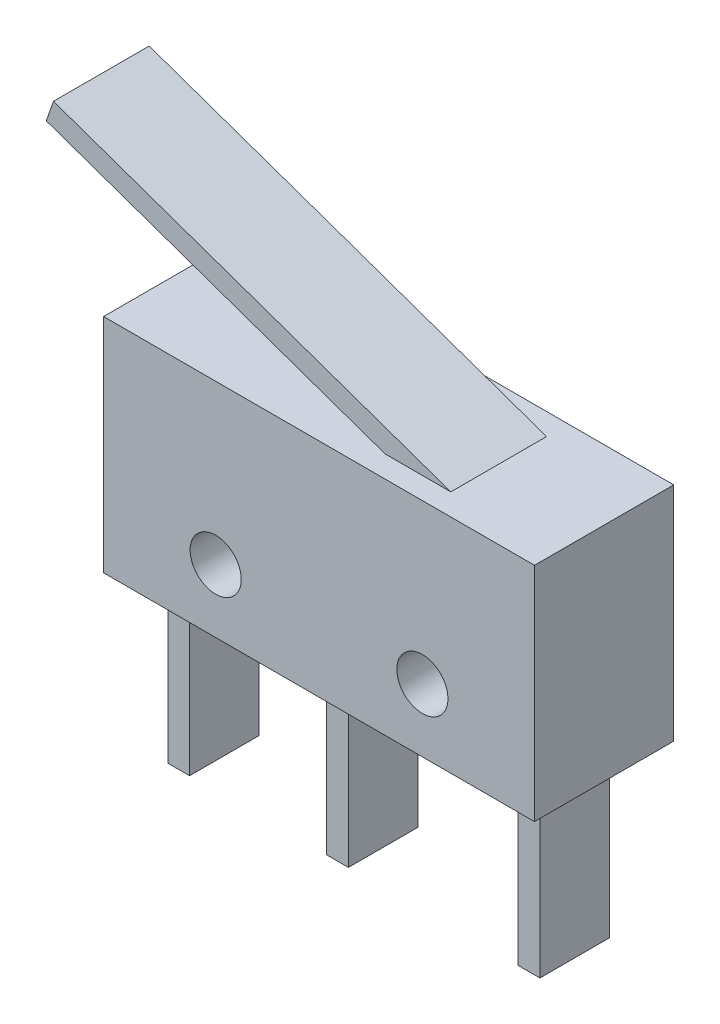
ISO-10303-21;
HEADER;
FILE_DESCRIPTION(('STEP AP214'),'2;1');
FILE_NAME('part.step','',(''),(''),'','','');
FILE_SCHEMA(('AUTOMOTIVE_DESIGN { 1 0 10303 214 1 1 1 1 }'));
ENDSEC;
DATA;
#1=APPLICATION_CONTEXT('core data for automotive mechanical design processes');
#2=APPLICATION_PROTOCOL_DEFINITION('international standard','automotive_design',2000,#1);
#3=PRODUCT_CONTEXT('',#1,'mechanical');
#4=PRODUCT('Part','Part','',(#3));
#5=PRODUCT_RELATED_PRODUCT_CATEGORY('part','',(#4));
#6=PRODUCT_DEFINITION_FORMATION('','',#4);
#7=PRODUCT_DEFINITION_CONTEXT('part definition',#1,'design');
#8=PRODUCT_DEFINITION('design','',#6,#7);
#9=PRODUCT_DEFINITION_SHAPE('','',#8);
#10=(LENGTH_UNIT() NAMED_UNIT(*) SI_UNIT(.MILLI.,.METRE.));
#11=(NAMED_UNIT(*) PLANE_ANGLE_UNIT() SI_UNIT($,.RADIAN.));
#12=(NAMED_UNIT(*) SI_UNIT($,.STERADIAN.) SOLID_ANGLE_UNIT());
#13=UNCERTAINTY_MEASURE_WITH_UNIT(LENGTH_MEASURE(1.E-05),#10,'distance_accuracy_value','');
#14=(GEOMETRIC_REPRESENTATION_CONTEXT(3) GLOBAL_UNCERTAINTY_ASSIGNED_CONTEXT((#13)) GLOBAL_UNIT_ASSIGNED_CONTEXT((#10,
#11,#12)) REPRESENTATION_CONTEXT('',''));
#15=CARTESIAN_POINT('',(0.,0.,0.));
#16=DIRECTION('',(0.,0.,1.));
#17=DIRECTION('',(1.,0.,0.));
#18=AXIS2_PLACEMENT_3D('',#15,#16,#17);
#19=CARTESIAN_POINT('',(-9.9,-5.1,6.4));
#20=DIRECTION('',(0.,1.,0.));
#21=DIRECTION('',(0.,0.,1.));
#22=AXIS2_PLACEMENT_3D('',#19,#20,#21);
#23=PLANE('',#22);
#24=DIRECTION('',(0.,0.,1.));
#25=VECTOR('',#24,1.);
#26=CARTESIAN_POINT('',(-0.249999999999999,-5.1,1.6));
#27=LINE('',#26,#25);
#28=CARTESIAN_POINT('',(-0.249999999999999,-5.1,1.6));
#29=VERTEX_POINT('',#28);
#30=CARTESIAN_POINT('',(-0.249999999999999,-5.1,4.8));
#31=VERTEX_POINT('',#30);
#32=EDGE_CURVE('E231',#29,#31,#27,.T.);
#33=ORIENTED_EDGE('',*,*,#32,.F.);
#34=DIRECTION('',(-1.,0.,0.));
#35=VECTOR('',#34,1.);
#36=CARTESIAN_POINT('',(-0.249999999999999,-5.1,1.6));
#37=LINE('',#36,#35);
#38=CARTESIAN_POINT('',(-1.25,-5.1,1.6));
#39=VERTEX_POINT('',#38);
#40=EDGE_CURVE('E236',#29,#39,#37,.T.);
#41=ORIENTED_EDGE('',*,*,#40,.T.);
#42=DIRECTION('',(0.,0.,1.));
#43=VECTOR('',#42,1.);
#44=CARTESIAN_POINT('',(-1.25,-5.1,1.6));
#45=LINE('',#44,#43);
#46=CARTESIAN_POINT('',(-1.25,-5.1,4.8));
#47=VERTEX_POINT('',#46);
#48=EDGE_CURVE('E252',#39,#47,#45,.T.);
#49=ORIENTED_EDGE('',*,*,#48,.T.);
#50=DIRECTION('',(1.,0.,0.));
#51=VECTOR('',#50,1.);
#52=CARTESIAN_POINT('',(-1.25,-5.1,4.8));
#53=LINE('',#52,#51);
#54=EDGE_CURVE('E249',#47,#31,#53,.T.);
#55=ORIENTED_EDGE('',*,*,#54,.T.);
#56=EDGE_LOOP('',(#33,#41,#49,#55));
#57=FACE_BOUND('',#56,.T.);
#58=DIRECTION('',(1.,0.,0.));
#59=VECTOR('',#58,1.);
#60=CARTESIAN_POINT('',(-9.9,-5.1,0.));
#61=LINE('',#60,#59);
#62=CARTESIAN_POINT('',(-9.9,-5.1,0.));
#63=VERTEX_POINT('',#62);
#64=CARTESIAN_POINT('',(9.9,-5.1,0.));
#65=VERTEX_POINT('',#64);
#66=EDGE_CURVE('E322',#63,#65,#61,.T.);
#67=ORIENTED_EDGE('',*,*,#66,.T.);
#68=DIRECTION('',(0.,0.,-1.));
#69=VECTOR('',#68,1.);
#70=CARTESIAN_POINT('',(9.9,-5.1,6.4));
#71=LINE('',#70,#69);
#72=CARTESIAN_POINT('',(9.9,-5.1,6.4));
#73=VERTEX_POINT('',#72);
#74=EDGE_CURVE('E331',#73,#65,#71,.T.);
#75=ORIENTED_EDGE('',*,*,#74,.F.);
#76=DIRECTION('',(1.,0.,0.));
#77=VECTOR('',#76,1.);
#78=CARTESIAN_POINT('',(-9.9,-5.1,6.4));
#79=LINE('',#78,#77);
#80=CARTESIAN_POINT('',(-9.9,-5.1,6.4));
#81=VERTEX_POINT('',#80);
#82=EDGE_CURVE('E328',#81,#73,#79,.T.);
#83=ORIENTED_EDGE('',*,*,#82,.F.);
#84=DIRECTION('',(0.,0.,-1.));
#85=VECTOR('',#84,1.);
#86=CARTESIAN_POINT('',(-9.9,-5.1,6.4));
#87=LINE('',#86,#85);
#88=EDGE_CURVE('E344',#81,#63,#87,.T.);
#89=ORIENTED_EDGE('',*,*,#88,.T.);
#90=EDGE_LOOP('',(#67,#75,#83,#89));
#91=FACE_BOUND('',#90,.T.);
#92=DIRECTION('',(0.,0.,-1.));
#93=VECTOR('',#92,1.);
#94=CARTESIAN_POINT('',(8.55,-5.1,1.6));
#95=LINE('',#94,#93);
#96=CARTESIAN_POINT('',(8.55,-5.1,1.6));
#97=VERTEX_POINT('',#96);
#98=CARTESIAN_POINT('',(8.55,-5.1,4.8));
#99=VERTEX_POINT('',#98);
#100=EDGE_CURVE('E267',#97,#99,#95,.F.);
#101=ORIENTED_EDGE('',*,*,#100,.F.);
#102=DIRECTION('',(-1.,0.,0.));
#103=VECTOR('',#102,1.);
#104=CARTESIAN_POINT('',(8.55,-5.1,1.6));
#105=LINE('',#104,#103);
#106=CARTESIAN_POINT('',(7.55,-5.1,1.6));
#107=VERTEX_POINT('',#106);
#108=EDGE_CURVE('E271',#97,#107,#105,.T.);
#109=ORIENTED_EDGE('',*,*,#108,.T.);
#110=DIRECTION('',(0.,0.,-1.));
#111=VECTOR('',#110,1.);
#112=CARTESIAN_POINT('',(7.55,-5.1,1.6));
#113=LINE('',#112,#111);
#114=CARTESIAN_POINT('',(7.55,-5.1,4.8));
#115=VERTEX_POINT('',#114);
#116=EDGE_CURVE('E287',#107,#115,#113,.F.);
#117=ORIENTED_EDGE('',*,*,#116,.T.);
#118=DIRECTION('',(1.,0.,0.));
#119=VECTOR('',#118,1.);
#120=CARTESIAN_POINT('',(7.55,-5.1,4.8));
#121=LINE('',#120,#119);
#122=EDGE_CURVE('E283',#115,#99,#121,.T.);
#123=ORIENTED_EDGE('',*,*,#122,.T.);
#124=EDGE_LOOP('',(#101,#109,#117,#123));
#125=FACE_BOUND('',#124,.T.);
#126=DIRECTION('',(0.,0.,-1.));
#127=VECTOR('',#126,1.);
#128=CARTESIAN_POINT('',(-7.55,-5.1,1.6));
#129=LINE('',#128,#127);
#130=CARTESIAN_POINT('',(-7.55,-5.1,1.6));
#131=VERTEX_POINT('',#130);
#132=CARTESIAN_POINT('',(-7.55,-5.1,4.8));
#133=VERTEX_POINT('',#132);
#134=EDGE_CURVE('E211',#131,#133,#129,.F.);
#135=ORIENTED_EDGE('',*,*,#134,.F.);
#136=DIRECTION('',(-1.,0.,0.));
#137=VECTOR('',#136,1.);
#138=CARTESIAN_POINT('',(-7.55,-5.1,1.6));
#139=LINE('',#138,#137);
#140=CARTESIAN_POINT('',(-8.55,-5.1,1.6));
#141=VERTEX_POINT('',#140);
#142=EDGE_CURVE('E201',#131,#141,#139,.T.);
#143=ORIENTED_EDGE('',*,*,#142,.T.);
#144=DIRECTION('',(0.,0.,-1.));
#145=VECTOR('',#144,1.);
#146=CARTESIAN_POINT('',(-8.55,-5.1,1.6));
#147=LINE('',#146,#145);
#148=CARTESIAN_POINT('',(-8.55,-5.1,4.8));
#149=VERTEX_POINT('',#148);
#150=EDGE_CURVE('E217',#141,#149,#147,.F.);
#151=ORIENTED_EDGE('',*,*,#150,.T.);
#152=DIRECTION('',(1.,0.,0.));
#153=VECTOR('',#152,1.);
#154=CARTESIAN_POINT('',(-8.55,-5.1,4.8));
#155=LINE('',#154,#153);
#156=EDGE_CURVE('E214',#149,#133,#155,.T.);
#157=ORIENTED_EDGE('',*,*,#156,.T.);
#158=EDGE_LOOP('',(#135,#143,#151,#157));
#159=FACE_BOUND('',#158,.T.);
#160=ADVANCED_FACE('F36',(#57,#91,#125,#159),#23,.F.);
#161=CARTESIAN_POINT('',(9.9,-5.1,6.4));
#162=DIRECTION('',(-1.,0.,0.));
#163=DIRECTION('',(0.,0.,1.));
#164=AXIS2_PLACEMENT_3D('',#161,#162,#163);
#165=PLANE('',#164);
#166=DIRECTION('',(0.,1.,0.));
#167=VECTOR('',#166,1.);
#168=CARTESIAN_POINT('',(9.9,-5.1,0.));
#169=LINE('',#168,#167);
#170=CARTESIAN_POINT('',(9.9,5.1,0.));
#171=VERTEX_POINT('',#170);
#172=EDGE_CURVE('E315',#65,#171,#169,.T.);
#173=ORIENTED_EDGE('',*,*,#172,.T.);
#174=DIRECTION('',(0.,0.,-1.));
#175=VECTOR('',#174,1.);
#176=CARTESIAN_POINT('',(9.9,5.1,6.4));
#177=LINE('',#176,#175);
#178=CARTESIAN_POINT('',(9.9,5.1,6.4));
#179=VERTEX_POINT('',#178);
#180=EDGE_CURVE('E352',#179,#171,#177,.T.);
#181=ORIENTED_EDGE('',*,*,#180,.F.);
#182=DIRECTION('',(0.,1.,0.));
#183=VECTOR('',#182,1.);
#184=CARTESIAN_POINT('',(9.9,-5.1,6.4));
#185=LINE('',#184,#183);
#186=EDGE_CURVE('E318',#73,#179,#185,.T.);
#187=ORIENTED_EDGE('',*,*,#186,.F.);
#188=ORIENTED_EDGE('',*,*,#74,.T.);
#189=EDGE_LOOP('',(#173,#181,#187,#188));
#190=FACE_BOUND('',#189,.T.);
#191=ADVANCED_FACE('F38',(#190),#165,.F.);
#192=CARTESIAN_POINT('',(-9.9,5.1,6.4));
#193=DIRECTION('',(0.,-1.,0.));
#194=DIRECTION('',(0.,0.,-1.));
#195=AXIS2_PLACEMENT_3D('',#192,#193,#194);
#196=PLANE('',#195);
#197=DIRECTION('',(0.,0.,-1.));
#198=VECTOR('',#197,1.);
#199=CARTESIAN_POINT('',(5.0549233723596,5.1,5.4));
#200=LINE('',#199,#198);
#201=CARTESIAN_POINT('',(5.0549233723596,5.1,5.4));
#202=VERTEX_POINT('',#201);
#203=CARTESIAN_POINT('',(5.0549233723596,5.1,1.));
#204=VERTEX_POINT('',#203);
#205=EDGE_CURVE('E54',#202,#204,#200,.T.);
#206=ORIENTED_EDGE('',*,*,#205,.F.);
#207=DIRECTION('',(-1.,0.,0.));
#208=VECTOR('',#207,1.);
#209=CARTESIAN_POINT('',(-9.9,5.1,5.4));
#210=LINE('',#209,#208);
#211=CARTESIAN_POINT('',(2.03816114007863,5.1,5.4));
#212=VERTEX_POINT('',#211);
#213=EDGE_CURVE('E11',#202,#212,#210,.T.);
#214=ORIENTED_EDGE('',*,*,#213,.T.);
#215=DIRECTION('',(0.,0.,-1.));
#216=VECTOR('',#215,1.);
#217=CARTESIAN_POINT('',(2.03816114007863,5.1,6.4));
#218=LINE('',#217,#216);
#219=CARTESIAN_POINT('',(2.03816114007864,5.1,1.));
#220=VERTEX_POINT('',#219);
#221=EDGE_CURVE('E44',#212,#220,#218,.T.);
#222=ORIENTED_EDGE('',*,*,#221,.T.);
#223=DIRECTION('',(-1.,0.,0.));
#224=VECTOR('',#223,1.);
#225=CARTESIAN_POINT('',(-9.9,5.1,1.));
#226=LINE('',#225,#224);
#227=EDGE_CURVE('E356',#204,#220,#226,.T.);
#228=ORIENTED_EDGE('',*,*,#227,.F.);
#229=EDGE_LOOP('',(#206,#214,#222,#228));
#230=FACE_BOUND('',#229,.T.);
#231=DIRECTION('',(-1.,0.,0.));
#232=VECTOR('',#231,1.);
#233=CARTESIAN_POINT('',(-9.9,5.1,0.));
#234=LINE('',#233,#232);
#235=CARTESIAN_POINT('',(-9.9,5.1,0.));
#236=VERTEX_POINT('',#235);
#237=EDGE_CURVE('E334',#171,#236,#234,.T.);
#238=ORIENTED_EDGE('',*,*,#237,.T.);
#239=DIRECTION('',(0.,0.,-1.));
#240=VECTOR('',#239,1.);
#241=CARTESIAN_POINT('',(-9.9,5.1,6.4));
#242=LINE('',#241,#240);
#243=CARTESIAN_POINT('',(-9.9,5.1,6.4));
#244=VERTEX_POINT('',#243);
#245=EDGE_CURVE('E348',#244,#236,#242,.T.);
#246=ORIENTED_EDGE('',*,*,#245,.F.);
#247=DIRECTION('',(-1.,0.,0.));
#248=VECTOR('',#247,1.);
#249=CARTESIAN_POINT('',(-9.9,5.1,6.4));
#250=LINE('',#249,#248);
#251=EDGE_CURVE('E321',#179,#244,#250,.T.);
#252=ORIENTED_EDGE('',*,*,#251,.F.);
#253=ORIENTED_EDGE('',*,*,#180,.T.);
#254=EDGE_LOOP('',(#238,#246,#252,#253));
#255=FACE_BOUND('',#254,.T.);
#256=ADVANCED_FACE('F360',(#230,#255),#196,.F.);
#257=CARTESIAN_POINT('',(-9.9,-5.1,6.4));
#258=DIRECTION('',(1.,0.,0.));
#259=DIRECTION('',(0.,0.,-1.));
#260=AXIS2_PLACEMENT_3D('',#257,#258,#259);
#261=PLANE('',#260);
#262=DIRECTION('',(0.,-1.,0.));
#263=VECTOR('',#262,1.);
#264=CARTESIAN_POINT('',(-9.9,-5.1,0.));
#265=LINE('',#264,#263);
#266=EDGE_CURVE('E337',#236,#63,#265,.T.);
#267=ORIENTED_EDGE('',*,*,#266,.T.);
#268=ORIENTED_EDGE('',*,*,#88,.F.);
#269=DIRECTION('',(0.,-1.,0.));
#270=VECTOR('',#269,1.);
#271=CARTESIAN_POINT('',(-9.9,-5.1,6.4));
#272=LINE('',#271,#270);
#273=EDGE_CURVE('E325',#244,#81,#272,.T.);
#274=ORIENTED_EDGE('',*,*,#273,.F.);
#275=ORIENTED_EDGE('',*,*,#245,.T.);
#276=EDGE_LOOP('',(#267,#268,#274,#275));
#277=FACE_BOUND('',#276,.T.);
#278=ADVANCED_FACE('F396',(#277),#261,.F.);
#279=CARTESIAN_POINT('',(0.,0.,6.4));
#280=DIRECTION('',(0.,0.,-1.));
#281=DIRECTION('',(-1.,0.,0.));
#282=AXIS2_PLACEMENT_3D('',#279,#280,#281);
#283=PLANE('',#282);
#284=CARTESIAN_POINT('',(-4.75,-2.2,6.4));
#285=DIRECTION('',(0.,0.,-1.));
#286=DIRECTION('',(-1.,0.,0.));
#287=AXIS2_PLACEMENT_3D('',#284,#285,#286);
#288=CIRCLE('',#287,1.175);
#289=CARTESIAN_POINT('',(-5.925,-2.2,6.4));
#290=VERTEX_POINT('',#289);
#291=EDGE_CURVE('E304',#290,#290,#288,.T.);
#292=ORIENTED_EDGE('',*,*,#291,.T.);
#293=EDGE_LOOP('',(#292));
#294=FACE_BOUND('',#293,.T.);
#295=CARTESIAN_POINT('',(4.75,-2.2,6.4));
#296=DIRECTION('',(0.,0.,-1.));
#297=DIRECTION('',(-1.,0.,0.));
#298=AXIS2_PLACEMENT_3D('',#295,#296,#297);
#299=CIRCLE('',#298,1.175);
#300=CARTESIAN_POINT('',(3.575,-2.2,6.4));
#301=VERTEX_POINT('',#300);
#302=EDGE_CURVE('E312',#301,#301,#299,.T.);
#303=ORIENTED_EDGE('',*,*,#302,.T.);
#304=EDGE_LOOP('',(#303));
#305=FACE_BOUND('',#304,.T.);
#306=ORIENTED_EDGE('',*,*,#186,.T.);
#307=ORIENTED_EDGE('',*,*,#251,.T.);
#308=ORIENTED_EDGE('',*,*,#273,.T.);
#309=ORIENTED_EDGE('',*,*,#82,.T.);
#310=EDGE_LOOP('',(#306,#307,#308,#309));
#311=FACE_BOUND('',#310,.T.);
#312=ADVANCED_FACE('F398',(#294,#305,#311),#283,.F.);
#313=CARTESIAN_POINT('',(0.,0.,0.));
#314=DIRECTION('',(0.,0.,-1.));
#315=DIRECTION('',(-1.,0.,0.));
#316=AXIS2_PLACEMENT_3D('',#313,#314,#315);
#317=PLANE('',#316);
#318=CARTESIAN_POINT('',(-4.75,-2.2,0.));
#319=DIRECTION('',(0.,0.,-1.));
#320=DIRECTION('',(-1.,0.,0.));
#321=AXIS2_PLACEMENT_3D('',#318,#319,#320);
#322=CIRCLE('',#321,1.175);
#323=CARTESIAN_POINT('',(-5.925,-2.2,0.));
#324=VERTEX_POINT('',#323);
#325=EDGE_CURVE('E303',#324,#324,#322,.T.);
#326=ORIENTED_EDGE('',*,*,#325,.F.);
#327=EDGE_LOOP('',(#326));
#328=FACE_BOUND('',#327,.T.);
#329=CARTESIAN_POINT('',(4.75,-2.2,0.));
#330=DIRECTION('',(0.,0.,-1.));
#331=DIRECTION('',(-1.,0.,0.));
#332=AXIS2_PLACEMENT_3D('',#329,#330,#331);
#333=CIRCLE('',#332,1.175);
#334=CARTESIAN_POINT('',(3.575,-2.2,0.));
#335=VERTEX_POINT('',#334);
#336=EDGE_CURVE('E308',#335,#335,#333,.T.);
#337=ORIENTED_EDGE('',*,*,#336,.F.);
#338=EDGE_LOOP('',(#337));
#339=FACE_BOUND('',#338,.T.);
#340=ORIENTED_EDGE('',*,*,#172,.F.);
#341=ORIENTED_EDGE('',*,*,#66,.F.);
#342=ORIENTED_EDGE('',*,*,#266,.F.);
#343=ORIENTED_EDGE('',*,*,#237,.F.);
#344=EDGE_LOOP('',(#340,#341,#342,#343));
#345=FACE_BOUND('',#344,.T.);
#346=ADVANCED_FACE('F394',(#328,#339,#345),#317,.T.);
#347=CARTESIAN_POINT('',(4.75,-2.2,6.4));
#348=DIRECTION('',(0.,0.,-1.));
#349=DIRECTION('',(-1.,0.,0.));
#350=AXIS2_PLACEMENT_3D('',#347,#348,#349);
#351=CYLINDRICAL_SURFACE('',#350,1.175);
#352=ORIENTED_EDGE('',*,*,#302,.F.);
#353=EDGE_LOOP('',(#352));
#354=FACE_BOUND('',#353,.T.);
#355=ORIENTED_EDGE('',*,*,#336,.T.);
#356=EDGE_LOOP('',(#355));
#357=FACE_BOUND('',#356,.T.);
#358=ADVANCED_FACE('F422',(#354,#357),#351,.F.);
#359=CARTESIAN_POINT('',(-4.75,-2.2,6.4));
#360=DIRECTION('',(0.,0.,-1.));
#361=DIRECTION('',(-1.,0.,0.));
#362=AXIS2_PLACEMENT_3D('',#359,#360,#361);
#363=CYLINDRICAL_SURFACE('',#362,1.175);
#364=ORIENTED_EDGE('',*,*,#291,.F.);
#365=EDGE_LOOP('',(#364));
#366=FACE_BOUND('',#365,.T.);
#367=ORIENTED_EDGE('',*,*,#325,.T.);
#368=EDGE_LOOP('',(#367));
#369=FACE_BOUND('',#368,.T.);
#370=ADVANCED_FACE('F429',(#366,#369),#363,.F.);
#371=CARTESIAN_POINT('',(8.55,-12.8,1.6));
#372=DIRECTION('',(-1.,0.,0.));
#373=DIRECTION('',(0.,0.,1.));
#374=AXIS2_PLACEMENT_3D('',#371,#372,#373);
#375=PLANE('',#374);
#376=ORIENTED_EDGE('',*,*,#100,.T.);
#377=DIRECTION('',(0.,1.,0.));
#378=VECTOR('',#377,1.);
#379=CARTESIAN_POINT('',(8.55,-12.8,4.8));
#380=LINE('',#379,#378);
#381=CARTESIAN_POINT('',(8.55,-12.8,4.8));
#382=VERTEX_POINT('',#381);
#383=EDGE_CURVE('E300',#382,#99,#380,.T.);
#384=ORIENTED_EDGE('',*,*,#383,.F.);
#385=DIRECTION('',(0.,0.,-1.));
#386=VECTOR('',#385,1.);
#387=CARTESIAN_POINT('',(8.55,-12.8,1.6));
#388=LINE('',#387,#386);
#389=CARTESIAN_POINT('',(8.55,-12.8,1.6));
#390=VERTEX_POINT('',#389);
#391=EDGE_CURVE('E268',#390,#382,#388,.F.);
#392=ORIENTED_EDGE('',*,*,#391,.F.);
#393=DIRECTION('',(0.,1.,0.));
#394=VECTOR('',#393,1.);
#395=CARTESIAN_POINT('',(8.55,-12.8,1.6));
#396=LINE('',#395,#394);
#397=EDGE_CURVE('E280',#390,#97,#396,.T.);
#398=ORIENTED_EDGE('',*,*,#397,.T.);
#399=EDGE_LOOP('',(#376,#384,#392,#398));
#400=FACE_BOUND('',#399,.T.);
#401=ADVANCED_FACE('F436',(#400),#375,.F.);
#402=CARTESIAN_POINT('',(7.55,-12.8,4.8));
#403=DIRECTION('',(0.,0.,1.));
#404=DIRECTION('',(1.,0.,0.));
#405=AXIS2_PLACEMENT_3D('',#402,#403,#404);
#406=PLANE('',#405);
#407=ORIENTED_EDGE('',*,*,#122,.F.);
#408=DIRECTION('',(0.,1.,0.));
#409=VECTOR('',#408,1.);
#410=CARTESIAN_POINT('',(7.55,-12.8,4.8));
#411=LINE('',#410,#409);
#412=CARTESIAN_POINT('',(7.55,-12.8,4.8));
#413=VERTEX_POINT('',#412);
#414=EDGE_CURVE('E298',#413,#115,#411,.T.);
#415=ORIENTED_EDGE('',*,*,#414,.F.);
#416=DIRECTION('',(1.,0.,0.));
#417=VECTOR('',#416,1.);
#418=CARTESIAN_POINT('',(7.55,-12.8,4.8));
#419=LINE('',#418,#417);
#420=EDGE_CURVE('E270',#413,#382,#419,.T.);
#421=ORIENTED_EDGE('',*,*,#420,.T.);
#422=ORIENTED_EDGE('',*,*,#383,.T.);
#423=EDGE_LOOP('',(#407,#415,#421,#422));
#424=FACE_BOUND('',#423,.T.);
#425=ADVANCED_FACE('F444',(#424),#406,.T.);
#426=CARTESIAN_POINT('',(7.55,-12.8,1.6));
#427=DIRECTION('',(-1.,0.,0.));
#428=DIRECTION('',(0.,0.,1.));
#429=AXIS2_PLACEMENT_3D('',#426,#427,#428);
#430=PLANE('',#429);
#431=ORIENTED_EDGE('',*,*,#116,.F.);
#432=DIRECTION('',(0.,1.,0.));
#433=VECTOR('',#432,1.);
#434=CARTESIAN_POINT('',(7.55,-12.8,1.6));
#435=LINE('',#434,#433);
#436=CARTESIAN_POINT('',(7.55,-12.8,1.6));
#437=VERTEX_POINT('',#436);
#438=EDGE_CURVE('E294',#437,#107,#435,.T.);
#439=ORIENTED_EDGE('',*,*,#438,.F.);
#440=DIRECTION('',(0.,0.,-1.));
#441=VECTOR('',#440,1.);
#442=CARTESIAN_POINT('',(7.55,-12.8,1.6));
#443=LINE('',#442,#441);
#444=EDGE_CURVE('E274',#437,#413,#443,.F.);
#445=ORIENTED_EDGE('',*,*,#444,.T.);
#446=ORIENTED_EDGE('',*,*,#414,.T.);
#447=EDGE_LOOP('',(#431,#439,#445,#446));
#448=FACE_BOUND('',#447,.T.);
#449=ADVANCED_FACE('F452',(#448),#430,.T.);
#450=CARTESIAN_POINT('',(8.55,-12.8,1.6));
#451=DIRECTION('',(0.,0.,-1.));
#452=DIRECTION('',(-1.,0.,0.));
#453=AXIS2_PLACEMENT_3D('',#450,#451,#452);
#454=PLANE('',#453);
#455=ORIENTED_EDGE('',*,*,#108,.F.);
#456=ORIENTED_EDGE('',*,*,#397,.F.);
#457=DIRECTION('',(-1.,0.,0.));
#458=VECTOR('',#457,1.);
#459=CARTESIAN_POINT('',(8.55,-12.8,1.6));
#460=LINE('',#459,#458);
#461=EDGE_CURVE('E277',#390,#437,#460,.T.);
#462=ORIENTED_EDGE('',*,*,#461,.T.);
#463=ORIENTED_EDGE('',*,*,#438,.T.);
#464=EDGE_LOOP('',(#455,#456,#462,#463));
#465=FACE_BOUND('',#464,.T.);
#466=ADVANCED_FACE('F460',(#465),#454,.T.);
#467=CARTESIAN_POINT('',(0.,-12.8,0.));
#468=DIRECTION('',(0.,-1.,0.));
#469=DIRECTION('',(-1.,0.,0.));
#470=AXIS2_PLACEMENT_3D('',#467,#468,#469);
#471=PLANE('',#470);
#472=ORIENTED_EDGE('',*,*,#391,.T.);
#473=ORIENTED_EDGE('',*,*,#420,.F.);
#474=ORIENTED_EDGE('',*,*,#444,.F.);
#475=ORIENTED_EDGE('',*,*,#461,.F.);
#476=EDGE_LOOP('',(#472,#473,#474,#475));
#477=FACE_BOUND('',#476,.T.);
#478=ADVANCED_FACE('F468',(#477),#471,.T.);
#479=CARTESIAN_POINT('',(-0.249999999999999,-12.8,1.6));
#480=DIRECTION('',(-1.,0.,0.));
#481=DIRECTION('',(0.,0.,1.));
#482=AXIS2_PLACEMENT_3D('',#479,#480,#481);
#483=PLANE('',#482);
#484=ORIENTED_EDGE('',*,*,#32,.T.);
#485=DIRECTION('',(0.,1.,0.));
#486=VECTOR('',#485,1.);
#487=CARTESIAN_POINT('',(-0.249999999999999,-12.8,4.8));
#488=LINE('',#487,#486);
#489=CARTESIAN_POINT('',(-0.249999999999999,-12.8,4.8));
#490=VERTEX_POINT('',#489);
#491=EDGE_CURVE('E264',#490,#31,#488,.T.);
#492=ORIENTED_EDGE('',*,*,#491,.F.);
#493=DIRECTION('',(0.,0.,1.));
#494=VECTOR('',#493,1.);
#495=CARTESIAN_POINT('',(-0.249999999999999,-12.8,1.6));
#496=LINE('',#495,#494);
#497=CARTESIAN_POINT('',(-0.249999999999999,-12.8,1.6));
#498=VERTEX_POINT('',#497);
#499=EDGE_CURVE('E232',#498,#490,#496,.T.);
#500=ORIENTED_EDGE('',*,*,#499,.F.);
#501=DIRECTION('',(0.,1.,0.));
#502=VECTOR('',#501,1.);
#503=CARTESIAN_POINT('',(-0.249999999999999,-12.8,1.6));
#504=LINE('',#503,#502);
#505=EDGE_CURVE('E246',#498,#29,#504,.T.);
#506=ORIENTED_EDGE('',*,*,#505,.T.);
#507=EDGE_LOOP('',(#484,#492,#500,#506));
#508=FACE_BOUND('',#507,.T.);
#509=ADVANCED_FACE('F476',(#508),#483,.F.);
#510=CARTESIAN_POINT('',(-1.25,-12.8,4.8));
#511=DIRECTION('',(0.,0.,1.));
#512=DIRECTION('',(1.,0.,0.));
#513=AXIS2_PLACEMENT_3D('',#510,#511,#512);
#514=PLANE('',#513);
#515=ORIENTED_EDGE('',*,*,#54,.F.);
#516=DIRECTION('',(0.,1.,0.));
#517=VECTOR('',#516,1.);
#518=CARTESIAN_POINT('',(-1.25,-12.8,4.8));
#519=LINE('',#518,#517);
#520=CARTESIAN_POINT('',(-1.25,-12.8,4.8));
#521=VERTEX_POINT('',#520);
#522=EDGE_CURVE('E262',#521,#47,#519,.T.);
#523=ORIENTED_EDGE('',*,*,#522,.F.);
#524=DIRECTION('',(1.,0.,0.));
#525=VECTOR('',#524,1.);
#526=CARTESIAN_POINT('',(-1.25,-12.8,4.8));
#527=LINE('',#526,#525);
#528=EDGE_CURVE('E235',#521,#490,#527,.T.);
#529=ORIENTED_EDGE('',*,*,#528,.T.);
#530=ORIENTED_EDGE('',*,*,#491,.T.);
#531=EDGE_LOOP('',(#515,#523,#529,#530));
#532=FACE_BOUND('',#531,.T.);
#533=ADVANCED_FACE('F484',(#532),#514,.T.);
#534=CARTESIAN_POINT('',(-1.25,-12.8,1.6));
#535=DIRECTION('',(-1.,0.,0.));
#536=DIRECTION('',(0.,0.,1.));
#537=AXIS2_PLACEMENT_3D('',#534,#535,#536);
#538=PLANE('',#537);
#539=ORIENTED_EDGE('',*,*,#48,.F.);
#540=DIRECTION('',(0.,1.,0.));
#541=VECTOR('',#540,1.);
#542=CARTESIAN_POINT('',(-1.25,-12.8,1.6));
#543=LINE('',#542,#541);
#544=CARTESIAN_POINT('',(-1.25,-12.8,1.6));
#545=VERTEX_POINT('',#544);
#546=EDGE_CURVE('E258',#545,#39,#543,.T.);
#547=ORIENTED_EDGE('',*,*,#546,.F.);
#548=DIRECTION('',(0.,0.,1.));
#549=VECTOR('',#548,1.);
#550=CARTESIAN_POINT('',(-1.25,-12.8,1.6));
#551=LINE('',#550,#549);
#552=EDGE_CURVE('E240',#545,#521,#551,.T.);
#553=ORIENTED_EDGE('',*,*,#552,.T.);
#554=ORIENTED_EDGE('',*,*,#522,.T.);
#555=EDGE_LOOP('',(#539,#547,#553,#554));
#556=FACE_BOUND('',#555,.T.);
#557=ADVANCED_FACE('F492',(#556),#538,.T.);
#558=CARTESIAN_POINT('',(-0.249999999999999,-12.8,1.6));
#559=DIRECTION('',(0.,0.,-1.));
#560=DIRECTION('',(-1.,0.,0.));
#561=AXIS2_PLACEMENT_3D('',#558,#559,#560);
#562=PLANE('',#561);
#563=ORIENTED_EDGE('',*,*,#40,.F.);
#564=ORIENTED_EDGE('',*,*,#505,.F.);
#565=DIRECTION('',(-1.,0.,0.));
#566=VECTOR('',#565,1.);
#567=CARTESIAN_POINT('',(-0.249999999999999,-12.8,1.6));
#568=LINE('',#567,#566);
#569=EDGE_CURVE('E243',#498,#545,#568,.T.);
#570=ORIENTED_EDGE('',*,*,#569,.T.);
#571=ORIENTED_EDGE('',*,*,#546,.T.);
#572=EDGE_LOOP('',(#563,#564,#570,#571));
#573=FACE_BOUND('',#572,.T.);
#574=ADVANCED_FACE('F500',(#573),#562,.T.);
#575=CARTESIAN_POINT('',(0.,-12.8,0.));
#576=DIRECTION('',(0.,1.,0.));
#577=DIRECTION('',(1.,0.,0.));
#578=AXIS2_PLACEMENT_3D('',#575,#576,#577);
#579=PLANE('',#578);
#580=ORIENTED_EDGE('',*,*,#499,.T.);
#581=ORIENTED_EDGE('',*,*,#528,.F.);
#582=ORIENTED_EDGE('',*,*,#552,.F.);
#583=ORIENTED_EDGE('',*,*,#569,.F.);
#584=EDGE_LOOP('',(#580,#581,#582,#583));
#585=FACE_BOUND('',#584,.T.);
#586=ADVANCED_FACE('F508',(#585),#579,.F.);
#587=CARTESIAN_POINT('',(-7.55,-12.8,1.6));
#588=DIRECTION('',(-1.,0.,0.));
#589=DIRECTION('',(0.,0.,1.));
#590=AXIS2_PLACEMENT_3D('',#587,#588,#589);
#591=PLANE('',#590);
#592=ORIENTED_EDGE('',*,*,#134,.T.);
#593=DIRECTION('',(0.,1.,0.));
#594=VECTOR('',#593,1.);
#595=CARTESIAN_POINT('',(-7.55,-12.8,4.8));
#596=LINE('',#595,#594);
#597=CARTESIAN_POINT('',(-7.55,-12.8,4.8));
#598=VERTEX_POINT('',#597);
#599=EDGE_CURVE('E229',#598,#133,#596,.T.);
#600=ORIENTED_EDGE('',*,*,#599,.F.);
#601=DIRECTION('',(0.,0.,-1.));
#602=VECTOR('',#601,1.);
#603=CARTESIAN_POINT('',(-7.55,-12.8,1.6));
#604=LINE('',#603,#602);
#605=CARTESIAN_POINT('',(-7.55,-12.8,1.6));
#606=VERTEX_POINT('',#605);
#607=EDGE_CURVE('E198',#606,#598,#604,.F.);
#608=ORIENTED_EDGE('',*,*,#607,.F.);
#609=DIRECTION('',(0.,1.,0.));
#610=VECTOR('',#609,1.);
#611=CARTESIAN_POINT('',(-7.55,-12.8,1.6));
#612=LINE('',#611,#610);
#613=EDGE_CURVE('E210',#606,#131,#612,.T.);
#614=ORIENTED_EDGE('',*,*,#613,.T.);
#615=EDGE_LOOP('',(#592,#600,#608,#614));
#616=FACE_BOUND('',#615,.T.);
#617=ADVANCED_FACE('F516',(#616),#591,.F.);
#618=CARTESIAN_POINT('',(-8.55,-12.8,4.8));
#619=DIRECTION('',(0.,0.,1.));
#620=DIRECTION('',(1.,0.,0.));
#621=AXIS2_PLACEMENT_3D('',#618,#619,#620);
#622=PLANE('',#621);
#623=ORIENTED_EDGE('',*,*,#156,.F.);
#624=DIRECTION('',(0.,1.,0.));
#625=VECTOR('',#624,1.);
#626=CARTESIAN_POINT('',(-8.55,-12.8,4.8));
#627=LINE('',#626,#625);
#628=CARTESIAN_POINT('',(-8.55,-12.8,4.8));
#629=VERTEX_POINT('',#628);
#630=EDGE_CURVE('E226',#629,#149,#627,.T.);
#631=ORIENTED_EDGE('',*,*,#630,.F.);
#632=DIRECTION('',(1.,0.,0.));
#633=VECTOR('',#632,1.);
#634=CARTESIAN_POINT('',(-8.55,-12.8,4.8));
#635=LINE('',#634,#633);
#636=EDGE_CURVE('E200',#629,#598,#635,.T.);
#637=ORIENTED_EDGE('',*,*,#636,.T.);
#638=ORIENTED_EDGE('',*,*,#599,.T.);
#639=EDGE_LOOP('',(#623,#631,#637,#638));
#640=FACE_BOUND('',#639,.T.);
#641=ADVANCED_FACE('F524',(#640),#622,.T.);
#642=CARTESIAN_POINT('',(-8.55,-12.8,1.6));
#643=DIRECTION('',(-1.,0.,0.));
#644=DIRECTION('',(0.,0.,1.));
#645=AXIS2_PLACEMENT_3D('',#642,#643,#644);
#646=PLANE('',#645);
#647=ORIENTED_EDGE('',*,*,#150,.F.);
#648=DIRECTION('',(0.,1.,0.));
#649=VECTOR('',#648,1.);
#650=CARTESIAN_POINT('',(-8.55,-12.8,1.6));
#651=LINE('',#650,#649);
#652=CARTESIAN_POINT('',(-8.55,-12.8,1.6));
#653=VERTEX_POINT('',#652);
#654=EDGE_CURVE('E223',#653,#141,#651,.T.);
#655=ORIENTED_EDGE('',*,*,#654,.F.);
#656=DIRECTION('',(0.,0.,-1.));
#657=VECTOR('',#656,1.);
#658=CARTESIAN_POINT('',(-8.55,-12.8,1.6));
#659=LINE('',#658,#657);
#660=EDGE_CURVE('E204',#653,#629,#659,.F.);
#661=ORIENTED_EDGE('',*,*,#660,.T.);
#662=ORIENTED_EDGE('',*,*,#630,.T.);
#663=EDGE_LOOP('',(#647,#655,#661,#662));
#664=FACE_BOUND('',#663,.T.);
#665=ADVANCED_FACE('F532',(#664),#646,.T.);
#666=CARTESIAN_POINT('',(-7.55,-12.8,1.6));
#667=DIRECTION('',(0.,0.,-1.));
#668=DIRECTION('',(-1.,0.,0.));
#669=AXIS2_PLACEMENT_3D('',#666,#667,#668);
#670=PLANE('',#669);
#671=ORIENTED_EDGE('',*,*,#142,.F.);
#672=ORIENTED_EDGE('',*,*,#613,.F.);
#673=DIRECTION('',(-1.,0.,0.));
#674=VECTOR('',#673,1.);
#675=CARTESIAN_POINT('',(-7.55,-12.8,1.6));
#676=LINE('',#675,#674);
#677=EDGE_CURVE('E207',#606,#653,#676,.T.);
#678=ORIENTED_EDGE('',*,*,#677,.T.);
#679=ORIENTED_EDGE('',*,*,#654,.T.);
#680=EDGE_LOOP('',(#671,#672,#678,#679));
#681=FACE_BOUND('',#680,.T.);
#682=ADVANCED_FACE('F540',(#681),#670,.T.);
#683=CARTESIAN_POINT('',(0.,-12.8,0.));
#684=DIRECTION('',(0.,-1.,0.));
#685=DIRECTION('',(-1.,0.,0.));
#686=AXIS2_PLACEMENT_3D('',#683,#684,#685);
#687=PLANE('',#686);
#688=ORIENTED_EDGE('',*,*,#607,.T.);
#689=ORIENTED_EDGE('',*,*,#636,.F.);
#690=ORIENTED_EDGE('',*,*,#660,.F.);
#691=ORIENTED_EDGE('',*,*,#677,.F.);
#692=EDGE_LOOP('',(#688,#689,#690,#691));
#693=FACE_BOUND('',#692,.T.);
#694=ADVANCED_FACE('F548',(#693),#687,.T.);
#695=CARTESIAN_POINT('',(4.72344216071505,4.15653817971967,5.4));
#696=DIRECTION('',(-0.331481211644546,-0.943461820280325,0.));
#697=DIRECTION('',(0.943461820280325,-0.331481211644546,0.));
#698=AXIS2_PLACEMENT_3D('',#695,#696,#697);
#699=PLANE('',#698);
#700=ORIENTED_EDGE('',*,*,#221,.F.);
#701=DIRECTION('',(-0.943461820280325,0.331481211644546,0.));
#702=VECTOR('',#701,1.);
#703=CARTESIAN_POINT('',(4.72344216071505,4.15653817971967,5.4));
#704=LINE('',#703,#702);
#705=CARTESIAN_POINT('',(-13.5348677028195,10.5715160262506,5.4));
#706=VERTEX_POINT('',#705);
#707=EDGE_CURVE('E169',#212,#706,#704,.T.);
#708=ORIENTED_EDGE('',*,*,#707,.T.);
#709=DIRECTION('',(0.,0.,-1.));
#710=VECTOR('',#709,1.);
#711=CARTESIAN_POINT('',(-13.5348677028195,10.5715160262506,5.4));
#712=LINE('',#711,#710);
#713=CARTESIAN_POINT('',(-13.5348677028195,10.5715160262506,1.));
#714=VERTEX_POINT('',#713);
#715=EDGE_CURVE('E174',#706,#714,#712,.T.);
#716=ORIENTED_EDGE('',*,*,#715,.T.);
#717=DIRECTION('',(-0.943461820280325,0.331481211644546,0.));
#718=VECTOR('',#717,1.);
#719=CARTESIAN_POINT('',(4.72344216071505,4.15653817971967,1.));
#720=LINE('',#719,#718);
#721=EDGE_CURVE('E365',#220,#714,#720,.T.);
#722=ORIENTED_EDGE('',*,*,#721,.F.);
#723=EDGE_LOOP('',(#700,#708,#716,#722));
#724=FACE_BOUND('',#723,.T.);
#725=ADVANCED_FACE('F171',(#724),#699,.T.);
#726=CARTESIAN_POINT('',(0.,0.,5.4));
#727=DIRECTION('',(0.,0.,1.));
#728=DIRECTION('',(1.,0.,0.));
#729=AXIS2_PLACEMENT_3D('',#726,#727,#728);
#730=PLANE('',#729);
#731=ORIENTED_EDGE('',*,*,#213,.F.);
#732=DIRECTION('',(-0.943461820280325,0.331481211644546,0.));
#733=VECTOR('',#732,1.);
#734=CARTESIAN_POINT('',(5.0549233723596,5.1,5.4));
#735=LINE('',#734,#733);
#736=CARTESIAN_POINT('',(-13.2033864911749,11.5149778465309,5.4));
#737=VERTEX_POINT('',#736);
#738=EDGE_CURVE('E183',#202,#737,#735,.T.);
#739=ORIENTED_EDGE('',*,*,#738,.T.);
#740=DIRECTION('',(-0.331481211644547,-0.943461820280324,0.));
#741=VECTOR('',#740,1.);
#742=CARTESIAN_POINT('',(-13.2033864911749,11.5149778465309,5.4));
#743=LINE('',#742,#741);
#744=EDGE_CURVE('E177',#737,#706,#743,.T.);
#745=ORIENTED_EDGE('',*,*,#744,.T.);
#746=ORIENTED_EDGE('',*,*,#707,.F.);
#747=EDGE_LOOP('',(#731,#739,#745,#746));
#748=FACE_BOUND('',#747,.T.);
#749=ADVANCED_FACE('F181',(#748),#730,.T.);
#750=CARTESIAN_POINT('',(0.,0.,1.));
#751=DIRECTION('',(0.,0.,1.));
#752=DIRECTION('',(1.,0.,0.));
#753=AXIS2_PLACEMENT_3D('',#750,#751,#752);
#754=PLANE('',#753);
#755=DIRECTION('',(-0.943461820280325,0.331481211644546,0.));
#756=VECTOR('',#755,1.);
#757=CARTESIAN_POINT('',(5.0549233723596,5.1,1.));
#758=LINE('',#757,#756);
#759=CARTESIAN_POINT('',(-13.2033864911749,11.5149778465309,1.));
#760=VERTEX_POINT('',#759);
#761=EDGE_CURVE('E178',#204,#760,#758,.T.);
#762=ORIENTED_EDGE('',*,*,#761,.F.);
#763=ORIENTED_EDGE('',*,*,#227,.T.);
#764=ORIENTED_EDGE('',*,*,#721,.T.);
#765=DIRECTION('',(-0.331481211644547,-0.943461820280324,0.));
#766=VECTOR('',#765,1.);
#767=CARTESIAN_POINT('',(-13.2033864911749,11.5149778465309,1.));
#768=LINE('',#767,#766);
#769=EDGE_CURVE('E190',#760,#714,#768,.T.);
#770=ORIENTED_EDGE('',*,*,#769,.F.);
#771=EDGE_LOOP('',(#762,#763,#764,#770));
#772=FACE_BOUND('',#771,.T.);
#773=ADVANCED_FACE('F364',(#772),#754,.F.);
#774=CARTESIAN_POINT('',(5.0549233723596,5.1,5.4));
#775=DIRECTION('',(-0.331481211644546,-0.943461820280325,0.));
#776=DIRECTION('',(0.943461820280325,-0.331481211644546,0.));
#777=AXIS2_PLACEMENT_3D('',#774,#775,#776);
#778=PLANE('',#777);
#779=ORIENTED_EDGE('',*,*,#761,.T.);
#780=DIRECTION('',(0.,0.,-1.));
#781=VECTOR('',#780,1.);
#782=CARTESIAN_POINT('',(-13.2033864911749,11.5149778465309,5.4));
#783=LINE('',#782,#781);
#784=EDGE_CURVE('E191',#737,#760,#783,.T.);
#785=ORIENTED_EDGE('',*,*,#784,.F.);
#786=ORIENTED_EDGE('',*,*,#738,.F.);
#787=ORIENTED_EDGE('',*,*,#205,.T.);
#788=EDGE_LOOP('',(#779,#785,#786,#787));
#789=FACE_BOUND('',#788,.T.);
#790=ADVANCED_FACE('F374',(#789),#778,.F.);
#791=CARTESIAN_POINT('',(-13.2033864911749,11.5149778465309,5.4));
#792=DIRECTION('',(0.943461820280324,-0.331481211644547,0.));
#793=DIRECTION('',(0.331481211644547,0.943461820280324,0.));
#794=AXIS2_PLACEMENT_3D('',#791,#792,#793);
#795=PLANE('',#794);
#796=ORIENTED_EDGE('',*,*,#769,.T.);
#797=ORIENTED_EDGE('',*,*,#715,.F.);
#798=ORIENTED_EDGE('',*,*,#744,.F.);
#799=ORIENTED_EDGE('',*,*,#784,.T.);
#800=EDGE_LOOP('',(#796,#797,#798,#799));
#801=FACE_BOUND('',#800,.T.);
#802=ADVANCED_FACE('F188',(#801),#795,.F.);
#803=CLOSED_SHELL('',(#160,#191,#256,#278,#312,#346,#358,#370,#401,#425,#449,#466,#478,#509,
#533,#557,#574,#586,#617,#641,#665,#682,#694,#725,#749,#773,#790,#802));
#804=MANIFOLD_SOLID_BREP('B2',#803);
#805=ADVANCED_BREP_SHAPE_REPRESENTATION('',(#18,#804),#14);
#806=SHAPE_DEFINITION_REPRESENTATION(#9,#805);
ENDSEC;
END-ISO-10303-21;
